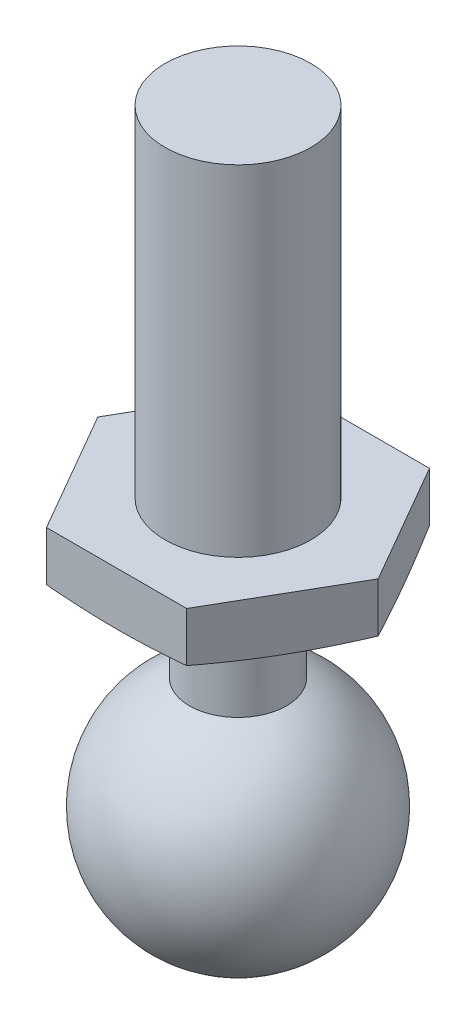
ISO-10303-21;
HEADER;
FILE_DESCRIPTION(('STEP AP214'),'2;1');
FILE_NAME('part.step','',(''),(''),'','','');
FILE_SCHEMA(('AUTOMOTIVE_DESIGN { 1 0 10303 214 1 1 1 1 }'));
ENDSEC;
DATA;
#1=APPLICATION_CONTEXT('core data for automotive mechanical design processes');
#2=APPLICATION_PROTOCOL_DEFINITION('international standard','automotive_design',2000,#1);
#3=PRODUCT_CONTEXT('',#1,'mechanical');
#4=PRODUCT('Part','Part','',(#3));
#5=PRODUCT_RELATED_PRODUCT_CATEGORY('part','',(#4));
#6=PRODUCT_DEFINITION_FORMATION('','',#4);
#7=PRODUCT_DEFINITION_CONTEXT('part definition',#1,'design');
#8=PRODUCT_DEFINITION('design','',#6,#7);
#9=PRODUCT_DEFINITION_SHAPE('','',#8);
#10=(LENGTH_UNIT() NAMED_UNIT(*) SI_UNIT(.MILLI.,.METRE.));
#11=(NAMED_UNIT(*) PLANE_ANGLE_UNIT() SI_UNIT($,.RADIAN.));
#12=(NAMED_UNIT(*) SI_UNIT($,.STERADIAN.) SOLID_ANGLE_UNIT());
#13=UNCERTAINTY_MEASURE_WITH_UNIT(LENGTH_MEASURE(1.E-05),#10,'distance_accuracy_value','');
#14=(GEOMETRIC_REPRESENTATION_CONTEXT(3) GLOBAL_UNCERTAINTY_ASSIGNED_CONTEXT((#13)) GLOBAL_UNIT_ASSIGNED_CONTEXT((#10,
#11,#12)) REPRESENTATION_CONTEXT('',''));
#15=CARTESIAN_POINT('',(0.,0.,0.));
#16=DIRECTION('',(0.,0.,1.));
#17=DIRECTION('',(1.,0.,0.));
#18=AXIS2_PLACEMENT_3D('',#15,#16,#17);
#19=CARTESIAN_POINT('',(0.,-1.35265396141693,0.));
#20=DIRECTION('',(0.,1.,0.));
#21=DIRECTION('',(0.,0.,1.));
#22=AXIS2_PLACEMENT_3D('',#19,#20,#21);
#23=CONICAL_SURFACE('',#22,1.,1.39626340159546);
#24=CARTESIAN_POINT('',(0.,-1.35265396141693,0.));
#25=DIRECTION('',(0.,-1.,0.));
#26=DIRECTION('',(0.,0.,-1.));
#27=AXIS2_PLACEMENT_3D('',#24,#25,#26);
#28=CIRCLE('',#27,1.);
#29=CARTESIAN_POINT('',(0.,-1.35265396141693,-1.));
#30=VERTEX_POINT('',#29);
#31=EDGE_CURVE('E43',#30,#30,#28,.T.);
#32=ORIENTED_EDGE('',*,*,#31,.F.);
#33=EDGE_LOOP('',(#32));
#34=FACE_BOUND('',#33,.T.);
#35=CARTESIAN_POINT('',(-4.35178786431024,-0.644036287997668,-2.5));
#36=CARTESIAN_POINT('',(-4.14193627308276,-0.676078443266939,-2.5));
#37=CARTESIAN_POINT('',(-3.9320061160949,-0.707637882512857,-2.5));
#38=CARTESIAN_POINT('',(-3.51189272953085,-0.769155320197357,-2.5));
#39=CARTESIAN_POINT('',(-3.30170947878789,-0.799113173573436,-2.5));
#40=CARTESIAN_POINT('',(-2.88017970644119,-0.856902233505525,-2.5));
#41=CARTESIAN_POINT('',(-2.66883192190967,-0.884724332295747,-2.5));
#42=CARTESIAN_POINT('',(-2.24570934242242,-0.937026760341865,-2.5));
#43=CARTESIAN_POINT('',(-2.03393453366674,-0.961506979784703,-2.5));
#44=CARTESIAN_POINT('',(-1.61240619275804,-1.00528012631561,-2.5));
#45=CARTESIAN_POINT('',(-1.40265893021013,-1.02463181983137,-2.5));
#46=CARTESIAN_POINT('',(-0.982648208636613,-1.05650898579663,-2.5));
#47=CARTESIAN_POINT('',(-0.772384815017567,-1.06903528244204,-2.5));
#48=CARTESIAN_POINT('',(-0.351902634676422,-1.08527841598575,-2.5));
#49=CARTESIAN_POINT('',(-0.141684541141491,-1.08901216350975,-2.5));
#50=CARTESIAN_POINT('',(0.278709004327902,-1.08698381304818,-2.5));
#51=CARTESIAN_POINT('',(0.488884455296936,-1.08122151985331,-2.5));
#52=CARTESIAN_POINT('',(0.851230925027751,-1.06403759142698,-2.5));
#53=CARTESIAN_POINT('',(1.00350351194761,-1.05460115450106,-2.5));
#54=CARTESIAN_POINT('',(1.30777400637347,-1.03208866040807,-2.5));
#55=CARTESIAN_POINT('',(1.45977191667072,-1.01901264043793,-2.5));
#56=CARTESIAN_POINT('',(1.76369841820404,-0.989977665999077,-2.5));
#57=CARTESIAN_POINT('',(1.91562662452937,-0.974014759231409,-2.5));
#58=CARTESIAN_POINT('',(2.2192375794225,-0.939897479711876,-2.5));
#59=CARTESIAN_POINT('',(2.37092032222341,-0.921743056208982,-2.5));
#60=CARTESIAN_POINT('',(2.67545249374304,-0.883603602011488,-2.5));
#61=CARTESIAN_POINT('',(2.82830001269499,-0.863603448459441,-2.5));
#62=CARTESIAN_POINT('',(3.13382217763901,-0.822324887162011,-2.5));
#63=CARTESIAN_POINT('',(3.28649682274871,-0.801046472921989,-2.5));
#64=CARTESIAN_POINT('',(3.59133987058711,-0.757569470849809,-2.5));
#65=CARTESIAN_POINT('',(3.74350860797057,-0.73537321814211,-2.5));
#66=CARTESIAN_POINT('',(4.04772858121144,-0.690221922288668,-2.5));
#67=CARTESIAN_POINT('',(4.19977982073275,-0.667266903868236,-2.5));
#68=CARTESIAN_POINT('',(4.35178786431024,-0.644036287997668,-2.5));
#69=B_SPLINE_CURVE_WITH_KNOTS('',3,(#35,#36,#37,#38,#39,#40,#41,#42,#43,#44,#45,#46,#47,#48,#49,
#50,#51,#52,#53,#54,#55,#56,#57,#58,#59,#60,#61,#62,#63,#64,#65,#66,#67,#68),.UNSPECIFIED.,.F.,
.F.,(4,2,2,2,2,2,2,2,2,2,2,2,2,2,2,2,4),(0.,0.636857995492099,1.27377357655624,1.91326959648742,
2.55278662499233,3.18462332153686,3.81638370417504,4.44692803219513,5.07748532242267,
5.53513200560773,5.9927740117676,6.45104736316598,6.90933132927127,7.37177581489304,
7.83422265032084,8.29555773886521,8.75687780903008),.UNSPECIFIED.);
#70=CARTESIAN_POINT('',(-1.44337567297406,-1.01996879323826,-2.5));
#71=VERTEX_POINT('',#70);
#72=CARTESIAN_POINT('',(1.44337567297407,-1.01996879323827,-2.5));
#73=VERTEX_POINT('',#72);
#74=EDGE_CURVE('E121',#71,#73,#69,.T.);
#75=ORIENTED_EDGE('',*,*,#74,.T.);
#76=CARTESIAN_POINT('',(1.44326020292023,-1.01994843153073,-2.5002));
#77=CARTESIAN_POINT('',(1.50332291805887,-1.03054468375176,-2.39616832573933));
#78=CARTESIAN_POINT('',(1.56343325575889,-1.04015113253336,-2.29205416678277));
#79=CARTESIAN_POINT('',(1.68374601000383,-1.0570130855626,-2.08366636363198));
#80=CARTESIAN_POINT('',(1.74394844050654,-1.06426818850539,-1.97939269526217));
#81=CARTESIAN_POINT('',(1.86428642853012,-1.07603900982871,-1.77096118592471));
#82=CARTESIAN_POINT('',(1.92442183257639,-1.08056084399192,-1.66680361078289));
#83=CARTESIAN_POINT('',(2.04472599629783,-1.08662296361426,-1.45843068685527));
#84=CARTESIAN_POINT('',(2.10489475287946,-1.08816349035423,-1.35421534342763));
#85=CARTESIAN_POINT('',(2.22523226604273,-1.08816349035423,-1.14578465657237));
#86=CARTESIAN_POINT('',(2.28540102262436,-1.08662296361426,-1.04156931314473));
#87=CARTESIAN_POINT('',(2.4057051863458,-1.08056084399192,-0.833196389217114));
#88=CARTESIAN_POINT('',(2.46584059039207,-1.07603900982871,-0.729038814075291));
#89=CARTESIAN_POINT('',(2.58617857841566,-1.06426818850539,-0.520607304737831));
#90=CARTESIAN_POINT('',(2.64638100891836,-1.0570130855626,-0.416333636368015));
#91=CARTESIAN_POINT('',(2.7666937631633,-1.04015113253336,-0.20794583321723));
#92=CARTESIAN_POINT('',(2.82680410086332,-1.03054468375176,-0.103831674260672));
#93=CARTESIAN_POINT('',(2.88686681600197,-1.01994843153073,0.000200000000000127));
#94=B_SPLINE_CURVE_WITH_KNOTS('',3,(#76,#77,#78,#79,#80,#81,#82,#83,#84,#85,#86,#87,#88,#89,#90,
#91,#92,#93),.UNSPECIFIED.,.F.,.F.,(4,2,2,2,2,2,2,2,4),(0.,0.361783441417082,0.723628596038175,
1.08466108341276,1.44566435076637,1.80666761811999,2.16770010549457,2.52954526011567,
2.89132870153275),.UNSPECIFIED.);
#95=CARTESIAN_POINT('',(2.88675134594813,-1.01996879323826,0.));
#96=VERTEX_POINT('',#95);
#97=EDGE_CURVE('E159',#73,#96,#94,.T.);
#98=ORIENTED_EDGE('',*,*,#97,.T.);
#99=CARTESIAN_POINT('',(2.88686681600197,-1.01994843153073,-0.000199999999999913));
#100=CARTESIAN_POINT('',(2.82680410086332,-1.03054468375176,0.103831674260672));
#101=CARTESIAN_POINT('',(2.7666937631633,-1.04015113253336,0.20794583321723));
#102=CARTESIAN_POINT('',(2.64638100891836,-1.0570130855626,0.416333636368015));
#103=CARTESIAN_POINT('',(2.58617857841566,-1.06426818850539,0.520607304737831));
#104=CARTESIAN_POINT('',(2.46584059039207,-1.07603900982871,0.729038814075291));
#105=CARTESIAN_POINT('',(2.4057051863458,-1.08056084399192,0.833196389217114));
#106=CARTESIAN_POINT('',(2.28540102262436,-1.08662296361426,1.04156931314473));
#107=CARTESIAN_POINT('',(2.22523226604273,-1.08816349035423,1.14578465657237));
#108=CARTESIAN_POINT('',(2.10489475287946,-1.08816349035423,1.35421534342763));
#109=CARTESIAN_POINT('',(2.04472599629783,-1.08662296361426,1.45843068685527));
#110=CARTESIAN_POINT('',(1.92442183257639,-1.08056084399192,1.66680361078289));
#111=CARTESIAN_POINT('',(1.86428642853012,-1.07603900982871,1.77096118592471));
#112=CARTESIAN_POINT('',(1.74394844050654,-1.06426818850539,1.97939269526217));
#113=CARTESIAN_POINT('',(1.68374601000383,-1.0570130855626,2.08366636363198));
#114=CARTESIAN_POINT('',(1.56343325575889,-1.04015113253337,2.29205416678277));
#115=CARTESIAN_POINT('',(1.50332291805887,-1.03054468375176,2.39616832573933));
#116=CARTESIAN_POINT('',(1.44326020292023,-1.01994843153073,2.5002));
#117=B_SPLINE_CURVE_WITH_KNOTS('',3,(#99,#100,#101,#102,#103,#104,#105,#106,#107,#108,#109,#110,
#111,#112,#113,#114,#115,#116),.UNSPECIFIED.,.F.,.F.,(4,2,2,2,2,2,2,2,4),(0.,0.361783441417082,
0.723628596038174,1.08466108341276,1.44566435076637,1.80666761811999,2.16770010549457,
2.52954526011566,2.89132870153275),.UNSPECIFIED.);
#118=CARTESIAN_POINT('',(1.44337567297406,-1.01996879323826,2.5));
#119=VERTEX_POINT('',#118);
#120=EDGE_CURVE('E168',#96,#119,#117,.T.);
#121=ORIENTED_EDGE('',*,*,#120,.T.);
#122=CARTESIAN_POINT('',(4.35178786431024,-0.644036287997668,2.5));
#123=CARTESIAN_POINT('',(4.14193627308276,-0.676078443266939,2.5));
#124=CARTESIAN_POINT('',(3.9320061160949,-0.707637882512857,2.5));
#125=CARTESIAN_POINT('',(3.51189272953085,-0.769155320197357,2.5));
#126=CARTESIAN_POINT('',(3.30170947878789,-0.799113173573437,2.5));
#127=CARTESIAN_POINT('',(2.88017970644119,-0.856902233505525,2.5));
#128=CARTESIAN_POINT('',(2.66883192190967,-0.884724332295747,2.5));
#129=CARTESIAN_POINT('',(2.24570934242242,-0.937026760341865,2.5));
#130=CARTESIAN_POINT('',(2.03393453366674,-0.961506979784703,2.5));
#131=CARTESIAN_POINT('',(1.61240619275804,-1.00528012631561,2.5));
#132=CARTESIAN_POINT('',(1.40265893021013,-1.02463181983137,2.5));
#133=CARTESIAN_POINT('',(0.982648208636613,-1.05650898579663,2.5));
#134=CARTESIAN_POINT('',(0.772384815017566,-1.06903528244204,2.5));
#135=CARTESIAN_POINT('',(0.351902634676421,-1.08527841598575,2.5));
#136=CARTESIAN_POINT('',(0.141684541141491,-1.08901216350975,2.5));
#137=CARTESIAN_POINT('',(-0.278709004327902,-1.08698381304818,2.5));
#138=CARTESIAN_POINT('',(-0.488884455296937,-1.08122151985331,2.5));
#139=CARTESIAN_POINT('',(-0.851230925027751,-1.06403759142698,2.5));
#140=CARTESIAN_POINT('',(-1.00350351194761,-1.05460115450106,2.5));
#141=CARTESIAN_POINT('',(-1.30777400637347,-1.03208866040807,2.5));
#142=CARTESIAN_POINT('',(-1.45977191667072,-1.01901264043793,2.5));
#143=CARTESIAN_POINT('',(-1.76369841820404,-0.989977665999077,2.5));
#144=CARTESIAN_POINT('',(-1.91562662452937,-0.974014759231409,2.5));
#145=CARTESIAN_POINT('',(-2.2192375794225,-0.939897479711876,2.5));
#146=CARTESIAN_POINT('',(-2.37092032222341,-0.921743056208982,2.5));
#147=CARTESIAN_POINT('',(-2.67545249374304,-0.883603602011488,2.5));
#148=CARTESIAN_POINT('',(-2.82830001269499,-0.863603448459441,2.5));
#149=CARTESIAN_POINT('',(-3.13382217763901,-0.822324887162012,2.5));
#150=CARTESIAN_POINT('',(-3.28649682274871,-0.801046472921989,2.5));
#151=CARTESIAN_POINT('',(-3.59133987058711,-0.757569470849809,2.5));
#152=CARTESIAN_POINT('',(-3.74350860797057,-0.735373218142111,2.5));
#153=CARTESIAN_POINT('',(-4.04772858121144,-0.690221922288668,2.5));
#154=CARTESIAN_POINT('',(-4.19977982073275,-0.667266903868237,2.5));
#155=CARTESIAN_POINT('',(-4.35178786431024,-0.644036287997668,2.5));
#156=B_SPLINE_CURVE_WITH_KNOTS('',3,(#122,#123,#124,#125,#126,#127,#128,#129,#130,#131,#132,
#133,#134,#135,#136,#137,#138,#139,#140,#141,#142,#143,#144,#145,#146,#147,#148,#149,#150,#151,
#152,#153,#154,#155),.UNSPECIFIED.,.F.,.F.,(4,2,2,2,2,2,2,2,2,2,2,2,2,2,2,2,4),(0.,
0.636857995492099,1.27377357655623,1.91326959648742,2.55278662499233,3.18462332153686,
3.81638370417504,4.44692803219513,5.07748532242267,5.53513200560773,5.9927740117676,
6.45104736316598,6.90933132927127,7.37177581489304,7.83422265032084,8.29555773886521,
8.75687780903008),.UNSPECIFIED.);
#157=CARTESIAN_POINT('',(-1.44337567297406,-1.01996879323826,2.5));
#158=VERTEX_POINT('',#157);
#159=EDGE_CURVE('E193',#119,#158,#156,.T.);
#160=ORIENTED_EDGE('',*,*,#159,.T.);
#161=CARTESIAN_POINT('',(-1.44326020292023,-1.01994843153073,2.5002));
#162=CARTESIAN_POINT('',(-1.50332291805887,-1.03054468375176,2.39616832573933));
#163=CARTESIAN_POINT('',(-1.56343325575889,-1.04015113253337,2.29205416678277));
#164=CARTESIAN_POINT('',(-1.68374601000383,-1.0570130855626,2.08366636363198));
#165=CARTESIAN_POINT('',(-1.74394844050654,-1.06426818850539,1.97939269526217));
#166=CARTESIAN_POINT('',(-1.86428642853012,-1.07603900982871,1.77096118592471));
#167=CARTESIAN_POINT('',(-1.92442183257639,-1.08056084399192,1.66680361078289));
#168=CARTESIAN_POINT('',(-2.04472599629783,-1.08662296361426,1.45843068685527));
#169=CARTESIAN_POINT('',(-2.10489475287946,-1.08816349035423,1.35421534342763));
#170=CARTESIAN_POINT('',(-2.22523226604273,-1.08816349035423,1.14578465657237));
#171=CARTESIAN_POINT('',(-2.28540102262436,-1.08662296361426,1.04156931314473));
#172=CARTESIAN_POINT('',(-2.4057051863458,-1.08056084399192,0.833196389217114));
#173=CARTESIAN_POINT('',(-2.46584059039207,-1.07603900982871,0.729038814075291));
#174=CARTESIAN_POINT('',(-2.58617857841566,-1.06426818850539,0.520607304737831));
#175=CARTESIAN_POINT('',(-2.64638100891836,-1.0570130855626,0.416333636368015));
#176=CARTESIAN_POINT('',(-2.7666937631633,-1.04015113253336,0.20794583321723));
#177=CARTESIAN_POINT('',(-2.82680410086332,-1.03054468375176,0.103831674260671));
#178=CARTESIAN_POINT('',(-2.88686681600197,-1.01994843153073,-0.000200000000000699));
#179=B_SPLINE_CURVE_WITH_KNOTS('',3,(#161,#162,#163,#164,#165,#166,#167,#168,#169,#170,#171,
#172,#173,#174,#175,#176,#177,#178),.UNSPECIFIED.,.F.,.F.,(4,2,2,2,2,2,2,2,4),(0.,
0.361783441417082,0.723628596038174,1.08466108341276,1.44566435076637,1.80666761811999,
2.16770010549457,2.52954526011567,2.89132870153275),.UNSPECIFIED.);
#180=CARTESIAN_POINT('',(-2.88675134594813,-1.01996879323826,0.));
#181=VERTEX_POINT('',#180);
#182=EDGE_CURVE('E194',#158,#181,#179,.T.);
#183=ORIENTED_EDGE('',*,*,#182,.T.);
#184=CARTESIAN_POINT('',(-2.88686681600197,-1.01994843153073,0.00019999999999957));
#185=CARTESIAN_POINT('',(-2.82680410086332,-1.03054468375176,-0.103831674260672));
#186=CARTESIAN_POINT('',(-2.7666937631633,-1.04015113253336,-0.207945833217231));
#187=CARTESIAN_POINT('',(-2.64638100891836,-1.0570130855626,-0.416333636368015));
#188=CARTESIAN_POINT('',(-2.58617857841566,-1.06426818850539,-0.520607304737831));
#189=CARTESIAN_POINT('',(-2.46584059039207,-1.07603900982871,-0.729038814075291));
#190=CARTESIAN_POINT('',(-2.4057051863458,-1.08056084399192,-0.833196389217114));
#191=CARTESIAN_POINT('',(-2.28540102262436,-1.08662296361426,-1.04156931314473));
#192=CARTESIAN_POINT('',(-2.22523226604273,-1.08816349035423,-1.14578465657237));
#193=CARTESIAN_POINT('',(-2.10489475287946,-1.08816349035423,-1.35421534342763));
#194=CARTESIAN_POINT('',(-2.04472599629783,-1.08662296361426,-1.45843068685527));
#195=CARTESIAN_POINT('',(-1.92442183257639,-1.08056084399192,-1.66680361078289));
#196=CARTESIAN_POINT('',(-1.86428642853012,-1.07603900982871,-1.77096118592471));
#197=CARTESIAN_POINT('',(-1.74394844050654,-1.06426818850539,-1.97939269526217));
#198=CARTESIAN_POINT('',(-1.68374601000383,-1.0570130855626,-2.08366636363198));
#199=CARTESIAN_POINT('',(-1.56343325575889,-1.04015113253337,-2.29205416678277));
#200=CARTESIAN_POINT('',(-1.50332291805887,-1.03054468375176,-2.39616832573933));
#201=CARTESIAN_POINT('',(-1.44326020292023,-1.01994843153073,-2.5002));
#202=B_SPLINE_CURVE_WITH_KNOTS('',3,(#184,#185,#186,#187,#188,#189,#190,#191,#192,#193,#194,
#195,#196,#197,#198,#199,#200,#201),.UNSPECIFIED.,.F.,.F.,(4,2,2,2,2,2,2,2,4),(0.,
0.361783441417082,0.723628596038174,1.08466108341276,1.44566435076637,1.80666761811999,
2.16770010549457,2.52954526011566,2.89132870153275),.UNSPECIFIED.);
#203=EDGE_CURVE('E91',#181,#71,#202,.T.);
#204=ORIENTED_EDGE('',*,*,#203,.T.);
#205=EDGE_LOOP('',(#75,#98,#121,#160,#183,#204));
#206=FACE_BOUND('',#205,.T.);
#207=ADVANCED_FACE('F35',(#34,#206),#23,.T.);
#208=CARTESIAN_POINT('',(0.,-5.5,0.));
#209=DIRECTION('',(0.,-1.,0.));
#210=DIRECTION('',(0.,0.,1.));
#211=AXIS2_PLACEMENT_3D('',#208,#209,#210);
#212=SPHERICAL_SURFACE('',#211,2.5);
#213=CARTESIAN_POINT('',(0.,-3.20871215252208,0.));
#214=DIRECTION('',(0.,-1.,0.));
#215=DIRECTION('',(0.,0.,-1.));
#216=AXIS2_PLACEMENT_3D('',#213,#214,#215);
#217=CIRCLE('',#216,1.);
#218=CARTESIAN_POINT('',(0.,-3.20871215252208,-1.));
#219=VERTEX_POINT('',#218);
#220=EDGE_CURVE('E12',#219,#219,#217,.T.);
#221=ORIENTED_EDGE('',*,*,#220,.T.);
#222=EDGE_LOOP('',(#221));
#223=FACE_BOUND('',#222,.T.);
#224=ADVANCED_FACE('F37',(#223),#212,.T.);
#225=CARTESIAN_POINT('',(0.,-8.,0.));
#226=DIRECTION('',(0.,-1.,0.));
#227=DIRECTION('',(0.,0.,-1.));
#228=AXIS2_PLACEMENT_3D('',#225,#226,#227);
#229=CYLINDRICAL_SURFACE('',#228,1.);
#230=ORIENTED_EDGE('',*,*,#31,.T.);
#231=EDGE_LOOP('',(#230));
#232=FACE_BOUND('',#231,.T.);
#233=ORIENTED_EDGE('',*,*,#220,.F.);
#234=EDGE_LOOP('',(#233));
#235=FACE_BOUND('',#234,.T.);
#236=ADVANCED_FACE('F155',(#232,#235),#229,.T.);
#237=CARTESIAN_POINT('',(2.88675134594813,-2.,0.));
#238=DIRECTION('',(0.866025403784439,0.,-0.5));
#239=DIRECTION('',(-0.5,0.,-0.866025403784439));
#240=AXIS2_PLACEMENT_3D('',#237,#238,#239);
#241=PLANE('',#240);
#242=DIRECTION('',(0.,1.,0.));
#243=VECTOR('',#242,1.);
#244=CARTESIAN_POINT('',(1.44337567297406,-2.,-2.5));
#245=LINE('',#244,#243);
#246=CARTESIAN_POINT('',(1.44337567297406,0.,-2.5));
#247=VERTEX_POINT('',#246);
#248=EDGE_CURVE('E50',#73,#247,#245,.T.);
#249=ORIENTED_EDGE('',*,*,#248,.T.);
#250=DIRECTION('',(-0.5,0.,-0.866025403784439));
#251=VECTOR('',#250,1.);
#252=CARTESIAN_POINT('',(2.88675134594813,0.,0.));
#253=LINE('',#252,#251);
#254=CARTESIAN_POINT('',(2.88675134594813,0.,0.));
#255=VERTEX_POINT('',#254);
#256=EDGE_CURVE('E112',#255,#247,#253,.T.);
#257=ORIENTED_EDGE('',*,*,#256,.F.);
#258=DIRECTION('',(0.,1.,0.));
#259=VECTOR('',#258,1.);
#260=CARTESIAN_POINT('',(2.88675134594813,-2.,0.));
#261=LINE('',#260,#259);
#262=EDGE_CURVE('E119',#96,#255,#261,.T.);
#263=ORIENTED_EDGE('',*,*,#262,.F.);
#264=ORIENTED_EDGE('',*,*,#97,.F.);
#265=EDGE_LOOP('',(#249,#257,#263,#264));
#266=FACE_BOUND('',#265,.T.);
#267=ADVANCED_FACE('F150',(#266),#241,.T.);
#268=CARTESIAN_POINT('',(1.44337567297406,-2.,2.5));
#269=DIRECTION('',(0.866025403784439,0.,0.5));
#270=DIRECTION('',(0.5,0.,-0.866025403784439));
#271=AXIS2_PLACEMENT_3D('',#268,#269,#270);
#272=PLANE('',#271);
#273=ORIENTED_EDGE('',*,*,#262,.T.);
#274=DIRECTION('',(0.5,0.,-0.866025403784439));
#275=VECTOR('',#274,1.);
#276=CARTESIAN_POINT('',(1.44337567297406,0.,2.5));
#277=LINE('',#276,#275);
#278=CARTESIAN_POINT('',(1.44337567297406,0.,2.5));
#279=VERTEX_POINT('',#278);
#280=EDGE_CURVE('E117',#279,#255,#277,.T.);
#281=ORIENTED_EDGE('',*,*,#280,.F.);
#282=DIRECTION('',(0.,1.,0.));
#283=VECTOR('',#282,1.);
#284=CARTESIAN_POINT('',(1.44337567297406,-2.,2.5));
#285=LINE('',#284,#283);
#286=EDGE_CURVE('E122',#119,#279,#285,.T.);
#287=ORIENTED_EDGE('',*,*,#286,.F.);
#288=ORIENTED_EDGE('',*,*,#120,.F.);
#289=EDGE_LOOP('',(#273,#281,#287,#288));
#290=FACE_BOUND('',#289,.T.);
#291=ADVANCED_FACE('F154',(#290),#272,.T.);
#292=CARTESIAN_POINT('',(-1.44337567297406,-2.,2.5));
#293=DIRECTION('',(0.,0.,1.));
#294=DIRECTION('',(1.,0.,0.));
#295=AXIS2_PLACEMENT_3D('',#292,#293,#294);
#296=PLANE('',#295);
#297=ORIENTED_EDGE('',*,*,#286,.T.);
#298=DIRECTION('',(1.,0.,0.));
#299=VECTOR('',#298,1.);
#300=CARTESIAN_POINT('',(-1.44337567297406,0.,2.5));
#301=LINE('',#300,#299);
#302=CARTESIAN_POINT('',(-1.44337567297406,0.,2.5));
#303=VERTEX_POINT('',#302);
#304=EDGE_CURVE('E104',#303,#279,#301,.T.);
#305=ORIENTED_EDGE('',*,*,#304,.F.);
#306=DIRECTION('',(0.,1.,0.));
#307=VECTOR('',#306,1.);
#308=CARTESIAN_POINT('',(-1.44337567297406,-2.,2.5));
#309=LINE('',#308,#307);
#310=EDGE_CURVE('E94',#158,#303,#309,.T.);
#311=ORIENTED_EDGE('',*,*,#310,.F.);
#312=ORIENTED_EDGE('',*,*,#159,.F.);
#313=EDGE_LOOP('',(#297,#305,#311,#312));
#314=FACE_BOUND('',#313,.T.);
#315=ADVANCED_FACE('F204',(#314),#296,.T.);
#316=CARTESIAN_POINT('',(-2.88675134594813,-2.,0.));
#317=DIRECTION('',(-0.866025403784439,0.,0.5));
#318=DIRECTION('',(0.5,0.,0.866025403784439));
#319=AXIS2_PLACEMENT_3D('',#316,#317,#318);
#320=PLANE('',#319);
#321=ORIENTED_EDGE('',*,*,#310,.T.);
#322=DIRECTION('',(0.5,0.,0.866025403784439));
#323=VECTOR('',#322,1.);
#324=CARTESIAN_POINT('',(-2.88675134594813,0.,0.));
#325=LINE('',#324,#323);
#326=CARTESIAN_POINT('',(-2.88675134594813,0.,0.));
#327=VERTEX_POINT('',#326);
#328=EDGE_CURVE('E98',#327,#303,#325,.T.);
#329=ORIENTED_EDGE('',*,*,#328,.F.);
#330=DIRECTION('',(0.,1.,0.));
#331=VECTOR('',#330,1.);
#332=CARTESIAN_POINT('',(-2.88675134594813,-2.,0.));
#333=LINE('',#332,#331);
#334=EDGE_CURVE('E87',#181,#327,#333,.T.);
#335=ORIENTED_EDGE('',*,*,#334,.F.);
#336=ORIENTED_EDGE('',*,*,#182,.F.);
#337=EDGE_LOOP('',(#321,#329,#335,#336));
#338=FACE_BOUND('',#337,.T.);
#339=ADVANCED_FACE('F99',(#338),#320,.T.);
#340=CARTESIAN_POINT('',(-1.44337567297406,-2.,-2.5));
#341=DIRECTION('',(-0.866025403784439,0.,-0.5));
#342=DIRECTION('',(-0.5,0.,0.866025403784439));
#343=AXIS2_PLACEMENT_3D('',#340,#341,#342);
#344=PLANE('',#343);
#345=ORIENTED_EDGE('',*,*,#334,.T.);
#346=DIRECTION('',(-0.5,0.,0.866025403784439));
#347=VECTOR('',#346,1.);
#348=CARTESIAN_POINT('',(-1.44337567297406,0.,-2.5));
#349=LINE('',#348,#347);
#350=CARTESIAN_POINT('',(-1.44337567297406,0.,-2.5));
#351=VERTEX_POINT('',#350);
#352=EDGE_CURVE('E58',#351,#327,#349,.T.);
#353=ORIENTED_EDGE('',*,*,#352,.F.);
#354=DIRECTION('',(0.,1.,0.));
#355=VECTOR('',#354,1.);
#356=CARTESIAN_POINT('',(-1.44337567297406,-2.,-2.5));
#357=LINE('',#356,#355);
#358=EDGE_CURVE('E95',#71,#351,#357,.T.);
#359=ORIENTED_EDGE('',*,*,#358,.F.);
#360=ORIENTED_EDGE('',*,*,#203,.F.);
#361=EDGE_LOOP('',(#345,#353,#359,#360));
#362=FACE_BOUND('',#361,.T.);
#363=ADVANCED_FACE('F89',(#362),#344,.T.);
#364=CARTESIAN_POINT('',(1.44337567297406,-2.,-2.5));
#365=DIRECTION('',(0.,0.,-1.));
#366=DIRECTION('',(-1.,0.,0.));
#367=AXIS2_PLACEMENT_3D('',#364,#365,#366);
#368=PLANE('',#367);
#369=ORIENTED_EDGE('',*,*,#358,.T.);
#370=DIRECTION('',(-1.,0.,0.));
#371=VECTOR('',#370,1.);
#372=CARTESIAN_POINT('',(1.44337567297406,0.,-2.5));
#373=LINE('',#372,#371);
#374=EDGE_CURVE('E110',#247,#351,#373,.T.);
#375=ORIENTED_EDGE('',*,*,#374,.F.);
#376=ORIENTED_EDGE('',*,*,#248,.F.);
#377=ORIENTED_EDGE('',*,*,#74,.F.);
#378=EDGE_LOOP('',(#369,#375,#376,#377));
#379=FACE_BOUND('',#378,.T.);
#380=ADVANCED_FACE('F143',(#379),#368,.T.);
#381=CARTESIAN_POINT('',(0.,7.,0.));
#382=DIRECTION('',(0.,1.,0.));
#383=DIRECTION('',(0.,0.,1.));
#384=AXIS2_PLACEMENT_3D('',#381,#382,#383);
#385=PLANE('',#384);
#386=CARTESIAN_POINT('',(0.,7.,0.));
#387=DIRECTION('',(0.,-1.,0.));
#388=DIRECTION('',(0.,0.,-1.));
#389=AXIS2_PLACEMENT_3D('',#386,#387,#388);
#390=CIRCLE('',#389,1.5);
#391=CARTESIAN_POINT('',(0.,7.,-1.5));
#392=VERTEX_POINT('',#391);
#393=EDGE_CURVE('E167',#392,#392,#390,.T.);
#394=ORIENTED_EDGE('',*,*,#393,.F.);
#395=EDGE_LOOP('',(#394));
#396=FACE_BOUND('',#395,.T.);
#397=ADVANCED_FACE('F147',(#396),#385,.T.);
#398=CARTESIAN_POINT('',(0.,-8.,0.));
#399=DIRECTION('',(0.,-1.,0.));
#400=DIRECTION('',(0.,0.,-1.));
#401=AXIS2_PLACEMENT_3D('',#398,#399,#400);
#402=CYLINDRICAL_SURFACE('',#401,1.5);
#403=ORIENTED_EDGE('',*,*,#393,.T.);
#404=EDGE_LOOP('',(#403));
#405=FACE_BOUND('',#404,.T.);
#406=CARTESIAN_POINT('',(0.,0.,0.));
#407=DIRECTION('',(0.,-1.,0.));
#408=DIRECTION('',(0.,0.,-1.));
#409=AXIS2_PLACEMENT_3D('',#406,#407,#408);
#410=CIRCLE('',#409,1.5);
#411=CARTESIAN_POINT('',(0.,0.,-1.5));
#412=VERTEX_POINT('',#411);
#413=EDGE_CURVE('E177',#412,#412,#410,.T.);
#414=ORIENTED_EDGE('',*,*,#413,.F.);
#415=EDGE_LOOP('',(#414));
#416=FACE_BOUND('',#415,.T.);
#417=ADVANCED_FACE('F227',(#405,#416),#402,.T.);
#418=CARTESIAN_POINT('',(0.,0.,-1.5));
#419=DIRECTION('',(0.,1.,0.));
#420=DIRECTION('',(0.,0.,1.));
#421=AXIS2_PLACEMENT_3D('',#418,#419,#420);
#422=PLANE('',#421);
#423=ORIENTED_EDGE('',*,*,#413,.T.);
#424=EDGE_LOOP('',(#423));
#425=FACE_BOUND('',#424,.T.);
#426=ORIENTED_EDGE('',*,*,#280,.T.);
#427=ORIENTED_EDGE('',*,*,#256,.T.);
#428=ORIENTED_EDGE('',*,*,#374,.T.);
#429=ORIENTED_EDGE('',*,*,#352,.T.);
#430=ORIENTED_EDGE('',*,*,#328,.T.);
#431=ORIENTED_EDGE('',*,*,#304,.T.);
#432=EDGE_LOOP('',(#426,#427,#428,#429,#430,#431));
#433=FACE_BOUND('',#432,.T.);
#434=ADVANCED_FACE('F108',(#425,#433),#422,.T.);
#435=CLOSED_SHELL('',(#207,#224,#236,#267,#291,#315,#339,#363,#380,#397,#417,#434));
#436=MANIFOLD_SOLID_BREP('B2',#435);
#437=ADVANCED_BREP_SHAPE_REPRESENTATION('',(#18,#436),#14);
#438=SHAPE_DEFINITION_REPRESENTATION(#9,#437);
ENDSEC;
END-ISO-10303-21;
